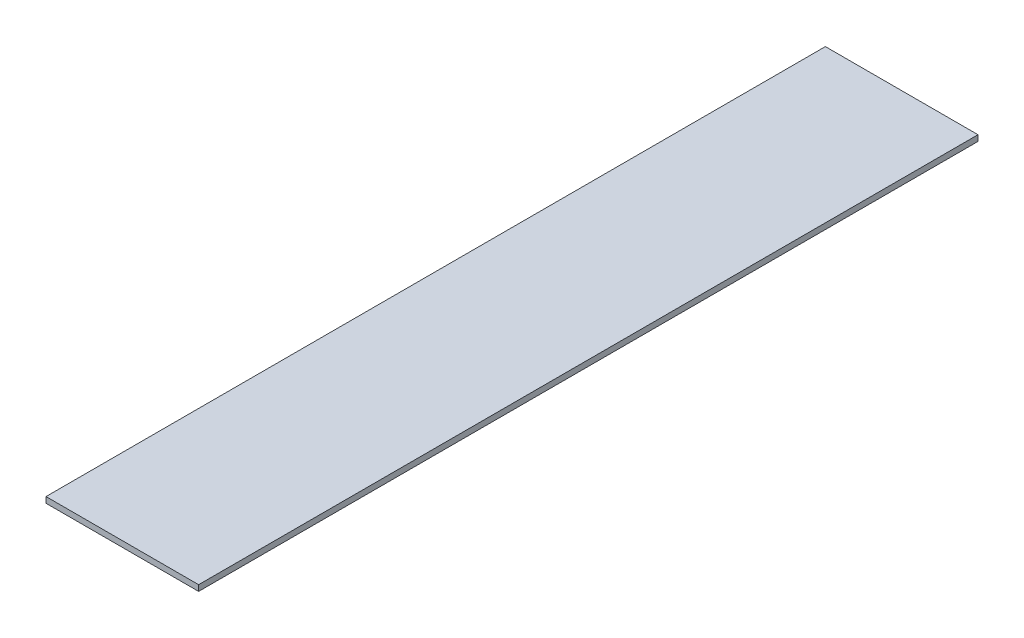
ISO-10303-21;
HEADER;
FILE_DESCRIPTION(('STEP AP214'),'2;1');
FILE_NAME('part.step','',(''),(''),'','','');
FILE_SCHEMA(('AUTOMOTIVE_DESIGN { 1 0 10303 214 1 1 1 1 }'));
ENDSEC;
DATA;
#1=APPLICATION_CONTEXT('core data for automotive mechanical design processes');
#2=APPLICATION_PROTOCOL_DEFINITION('international standard','automotive_design',2000,#1);
#3=PRODUCT_CONTEXT('',#1,'mechanical');
#4=PRODUCT('Part','Part','',(#3));
#5=PRODUCT_RELATED_PRODUCT_CATEGORY('part','',(#4));
#6=PRODUCT_DEFINITION_FORMATION('','',#4);
#7=PRODUCT_DEFINITION_CONTEXT('part definition',#1,'design');
#8=PRODUCT_DEFINITION('design','',#6,#7);
#9=PRODUCT_DEFINITION_SHAPE('','',#8);
#10=(LENGTH_UNIT() NAMED_UNIT(*) SI_UNIT(.MILLI.,.METRE.));
#11=(NAMED_UNIT(*) PLANE_ANGLE_UNIT() SI_UNIT($,.RADIAN.));
#12=(NAMED_UNIT(*) SI_UNIT($,.STERADIAN.) SOLID_ANGLE_UNIT());
#13=UNCERTAINTY_MEASURE_WITH_UNIT(LENGTH_MEASURE(1.E-05),#10,'distance_accuracy_value','');
#14=(GEOMETRIC_REPRESENTATION_CONTEXT(3) GLOBAL_UNCERTAINTY_ASSIGNED_CONTEXT((#13)) GLOBAL_UNIT_ASSIGNED_CONTEXT((#10,
#11,#12)) REPRESENTATION_CONTEXT('',''));
#15=CARTESIAN_POINT('',(0.,0.,0.));
#16=DIRECTION('',(0.,0.,1.));
#17=DIRECTION('',(1.,0.,0.));
#18=AXIS2_PLACEMENT_3D('',#15,#16,#17);
#19=CARTESIAN_POINT('',(0.,18.,0.));
#20=DIRECTION('',(1.,0.,0.));
#21=DIRECTION('',(0.,0.,-1.));
#22=AXIS2_PLACEMENT_3D('',#19,#20,#21);
#23=PLANE('',#22);
#24=DIRECTION('',(0.,0.,1.));
#25=VECTOR('',#24,1.);
#26=CARTESIAN_POINT('',(0.,0.,0.));
#27=LINE('',#26,#25);
#28=CARTESIAN_POINT('',(0.,0.,-2400.));
#29=VERTEX_POINT('',#28);
#30=CARTESIAN_POINT('',(0.,0.,0.));
#31=VERTEX_POINT('',#30);
#32=EDGE_CURVE('E96',#29,#31,#27,.T.);
#33=ORIENTED_EDGE('',*,*,#32,.T.);
#34=DIRECTION('',(0.,-1.,0.));
#35=VECTOR('',#34,1.);
#36=CARTESIAN_POINT('',(0.,18.,0.));
#37=LINE('',#36,#35);
#38=CARTESIAN_POINT('',(0.,18.,0.));
#39=VERTEX_POINT('',#38);
#40=EDGE_CURVE('E11',#39,#31,#37,.T.);
#41=ORIENTED_EDGE('',*,*,#40,.F.);
#42=DIRECTION('',(0.,0.,1.));
#43=VECTOR('',#42,1.);
#44=CARTESIAN_POINT('',(0.,18.,0.));
#45=LINE('',#44,#43);
#46=CARTESIAN_POINT('',(0.,18.,-2400.));
#47=VERTEX_POINT('',#46);
#48=EDGE_CURVE('E84',#47,#39,#45,.T.);
#49=ORIENTED_EDGE('',*,*,#48,.F.);
#50=DIRECTION('',(0.,-1.,0.));
#51=VECTOR('',#50,1.);
#52=CARTESIAN_POINT('',(0.,18.,-2400.));
#53=LINE('',#52,#51);
#54=EDGE_CURVE('E92',#47,#29,#53,.T.);
#55=ORIENTED_EDGE('',*,*,#54,.T.);
#56=EDGE_LOOP('',(#33,#41,#49,#55));
#57=FACE_BOUND('',#56,.T.);
#58=ADVANCED_FACE('F33',(#57),#23,.F.);
#59=CARTESIAN_POINT('',(0.,18.,0.));
#60=DIRECTION('',(0.,0.,-1.));
#61=DIRECTION('',(-1.,0.,0.));
#62=AXIS2_PLACEMENT_3D('',#59,#60,#61);
#63=PLANE('',#62);
#64=DIRECTION('',(1.,0.,0.));
#65=VECTOR('',#64,1.);
#66=CARTESIAN_POINT('',(0.,0.,0.));
#67=LINE('',#66,#65);
#68=CARTESIAN_POINT('',(470.,0.,0.));
#69=VERTEX_POINT('',#68);
#70=EDGE_CURVE('E88',#31,#69,#67,.T.);
#71=ORIENTED_EDGE('',*,*,#70,.T.);
#72=DIRECTION('',(0.,-1.,0.));
#73=VECTOR('',#72,1.);
#74=CARTESIAN_POINT('',(470.,18.,0.));
#75=LINE('',#74,#73);
#76=CARTESIAN_POINT('',(470.,18.,0.));
#77=VERTEX_POINT('',#76);
#78=EDGE_CURVE('E41',#77,#69,#75,.T.);
#79=ORIENTED_EDGE('',*,*,#78,.F.);
#80=DIRECTION('',(1.,0.,0.));
#81=VECTOR('',#80,1.);
#82=CARTESIAN_POINT('',(0.,18.,0.));
#83=LINE('',#82,#81);
#84=EDGE_CURVE('E79',#39,#77,#83,.T.);
#85=ORIENTED_EDGE('',*,*,#84,.F.);
#86=ORIENTED_EDGE('',*,*,#40,.T.);
#87=EDGE_LOOP('',(#71,#79,#85,#86));
#88=FACE_BOUND('',#87,.T.);
#89=ADVANCED_FACE('F87',(#88),#63,.F.);
#90=CARTESIAN_POINT('',(470.,18.,0.));
#91=DIRECTION('',(-1.,0.,0.));
#92=DIRECTION('',(0.,0.,1.));
#93=AXIS2_PLACEMENT_3D('',#90,#91,#92);
#94=PLANE('',#93);
#95=DIRECTION('',(0.,0.,-1.));
#96=VECTOR('',#95,1.);
#97=CARTESIAN_POINT('',(470.,0.,0.));
#98=LINE('',#97,#96);
#99=CARTESIAN_POINT('',(470.,0.,-2400.));
#100=VERTEX_POINT('',#99);
#101=EDGE_CURVE('E66',#69,#100,#98,.T.);
#102=ORIENTED_EDGE('',*,*,#101,.T.);
#103=DIRECTION('',(0.,-1.,0.));
#104=VECTOR('',#103,1.);
#105=CARTESIAN_POINT('',(470.,18.,-2400.));
#106=LINE('',#105,#104);
#107=CARTESIAN_POINT('',(470.,18.,-2400.));
#108=VERTEX_POINT('',#107);
#109=EDGE_CURVE('E89',#108,#100,#106,.T.);
#110=ORIENTED_EDGE('',*,*,#109,.F.);
#111=DIRECTION('',(0.,0.,-1.));
#112=VECTOR('',#111,1.);
#113=CARTESIAN_POINT('',(470.,18.,0.));
#114=LINE('',#113,#112);
#115=EDGE_CURVE('E82',#77,#108,#114,.T.);
#116=ORIENTED_EDGE('',*,*,#115,.F.);
#117=ORIENTED_EDGE('',*,*,#78,.T.);
#118=EDGE_LOOP('',(#102,#110,#116,#117));
#119=FACE_BOUND('',#118,.T.);
#120=ADVANCED_FACE('F90',(#119),#94,.F.);
#121=CARTESIAN_POINT('',(0.,18.,-2400.));
#122=DIRECTION('',(0.,0.,1.));
#123=DIRECTION('',(1.,0.,0.));
#124=AXIS2_PLACEMENT_3D('',#121,#122,#123);
#125=PLANE('',#124);
#126=DIRECTION('',(-1.,0.,0.));
#127=VECTOR('',#126,1.);
#128=CARTESIAN_POINT('',(0.,0.,-2400.));
#129=LINE('',#128,#127);
#130=EDGE_CURVE('E72',#100,#29,#129,.T.);
#131=ORIENTED_EDGE('',*,*,#130,.T.);
#132=ORIENTED_EDGE('',*,*,#54,.F.);
#133=DIRECTION('',(-1.,0.,0.));
#134=VECTOR('',#133,1.);
#135=CARTESIAN_POINT('',(0.,18.,-2400.));
#136=LINE('',#135,#134);
#137=EDGE_CURVE('E49',#108,#47,#136,.T.);
#138=ORIENTED_EDGE('',*,*,#137,.F.);
#139=ORIENTED_EDGE('',*,*,#109,.T.);
#140=EDGE_LOOP('',(#131,#132,#138,#139));
#141=FACE_BOUND('',#140,.T.);
#142=ADVANCED_FACE('F103',(#141),#125,.F.);
#143=CARTESIAN_POINT('',(0.,18.,0.));
#144=DIRECTION('',(0.,-1.,0.));
#145=DIRECTION('',(0.,0.,-1.));
#146=AXIS2_PLACEMENT_3D('',#143,#144,#145);
#147=PLANE('',#146);
#148=ORIENTED_EDGE('',*,*,#48,.T.);
#149=ORIENTED_EDGE('',*,*,#84,.T.);
#150=ORIENTED_EDGE('',*,*,#115,.T.);
#151=ORIENTED_EDGE('',*,*,#137,.T.);
#152=EDGE_LOOP('',(#148,#149,#150,#151));
#153=FACE_BOUND('',#152,.T.);
#154=ADVANCED_FACE('F80',(#153),#147,.F.);
#155=CARTESIAN_POINT('',(0.,0.,0.));
#156=DIRECTION('',(0.,-1.,0.));
#157=DIRECTION('',(0.,0.,-1.));
#158=AXIS2_PLACEMENT_3D('',#155,#156,#157);
#159=PLANE('',#158);
#160=ORIENTED_EDGE('',*,*,#32,.F.);
#161=ORIENTED_EDGE('',*,*,#130,.F.);
#162=ORIENTED_EDGE('',*,*,#101,.F.);
#163=ORIENTED_EDGE('',*,*,#70,.F.);
#164=EDGE_LOOP('',(#160,#161,#162,#163));
#165=FACE_BOUND('',#164,.T.);
#166=ADVANCED_FACE('F106',(#165),#159,.T.);
#167=CLOSED_SHELL('',(#58,#89,#120,#142,#154,#166));
#168=MANIFOLD_SOLID_BREP('B2',#167);
#169=ADVANCED_BREP_SHAPE_REPRESENTATION('',(#18,#168),#14);
#170=SHAPE_DEFINITION_REPRESENTATION(#9,#169);
ENDSEC;
END-ISO-10303-21;
